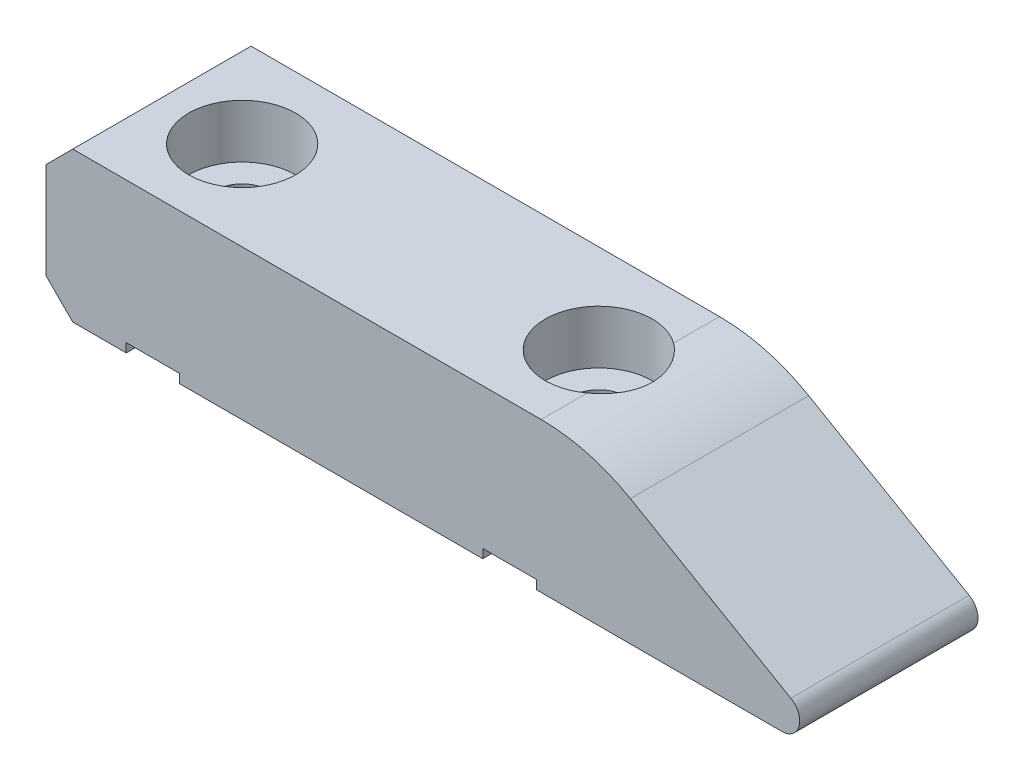
ISO-10303-21;
HEADER;
FILE_DESCRIPTION(('STEP AP214'),'2;1');
FILE_NAME('part.step','',(''),(''),'','','');
FILE_SCHEMA(('AUTOMOTIVE_DESIGN { 1 0 10303 214 1 1 1 1 }'));
ENDSEC;
DATA;
#1=APPLICATION_CONTEXT('core data for automotive mechanical design processes');
#2=APPLICATION_PROTOCOL_DEFINITION('international standard','automotive_design',2000,#1);
#3=PRODUCT_CONTEXT('',#1,'mechanical');
#4=PRODUCT('Part','Part','',(#3));
#5=PRODUCT_RELATED_PRODUCT_CATEGORY('part','',(#4));
#6=PRODUCT_DEFINITION_FORMATION('','',#4);
#7=PRODUCT_DEFINITION_CONTEXT('part definition',#1,'design');
#8=PRODUCT_DEFINITION('design','',#6,#7);
#9=PRODUCT_DEFINITION_SHAPE('','',#8);
#10=(LENGTH_UNIT() NAMED_UNIT(*) SI_UNIT(.MILLI.,.METRE.));
#11=(NAMED_UNIT(*) PLANE_ANGLE_UNIT() SI_UNIT($,.RADIAN.));
#12=(NAMED_UNIT(*) SI_UNIT($,.STERADIAN.) SOLID_ANGLE_UNIT());
#13=UNCERTAINTY_MEASURE_WITH_UNIT(LENGTH_MEASURE(1.E-05),#10,'distance_accuracy_value','');
#14=(GEOMETRIC_REPRESENTATION_CONTEXT(3) GLOBAL_UNCERTAINTY_ASSIGNED_CONTEXT((#13)) GLOBAL_UNIT_ASSIGNED_CONTEXT((#10,
#11,#12)) REPRESENTATION_CONTEXT('',''));
#15=CARTESIAN_POINT('',(0.,0.,0.));
#16=DIRECTION('',(0.,0.,1.));
#17=DIRECTION('',(1.,0.,0.));
#18=AXIS2_PLACEMENT_3D('',#15,#16,#17);
#19=CARTESIAN_POINT('',(-45.,0.,5.));
#20=DIRECTION('',(0.,1.,0.));
#21=DIRECTION('',(0.,0.,1.));
#22=AXIS2_PLACEMENT_3D('',#19,#20,#21);
#23=PLANE('',#22);
#24=DIRECTION('',(1.,0.,0.));
#25=VECTOR('',#24,1.);
#26=CARTESIAN_POINT('',(-45.,0.,5.));
#27=LINE('',#26,#25);
#28=CARTESIAN_POINT('',(-17.4946618485802,0.,5.));
#29=VERTEX_POINT('',#28);
#30=CARTESIAN_POINT('',(-3.73205080756894,0.,5.));
#31=VERTEX_POINT('',#30);
#32=EDGE_CURVE('E278',#29,#31,#27,.T.);
#33=ORIENTED_EDGE('',*,*,#32,.F.);
#34=DIRECTION('',(0.,0.,1.));
#35=VECTOR('',#34,1.);
#36=CARTESIAN_POINT('',(-17.4946618485802,0.,-4.99999999999994));
#37=LINE('',#36,#35);
#38=CARTESIAN_POINT('',(-17.4946618485802,0.,-4.99999999999994));
#39=VERTEX_POINT('',#38);
#40=EDGE_CURVE('E168',#39,#29,#37,.T.);
#41=ORIENTED_EDGE('',*,*,#40,.F.);
#42=DIRECTION('',(1.,0.,0.));
#43=VECTOR('',#42,1.);
#44=CARTESIAN_POINT('',(-45.,0.,-5.));
#45=LINE('',#44,#43);
#46=CARTESIAN_POINT('',(-3.73205080756894,0.,-5.));
#47=VERTEX_POINT('',#46);
#48=EDGE_CURVE('E295',#39,#47,#45,.T.);
#49=ORIENTED_EDGE('',*,*,#48,.T.);
#50=DIRECTION('',(0.,0.,-1.));
#51=VECTOR('',#50,1.);
#52=CARTESIAN_POINT('',(-3.73205080756892,0.,5.));
#53=LINE('',#52,#51);
#54=EDGE_CURVE('E398',#47,#31,#53,.F.);
#55=ORIENTED_EDGE('',*,*,#54,.T.);
#56=EDGE_LOOP('',(#33,#41,#49,#55));
#57=FACE_BOUND('',#56,.T.);
#58=ADVANCED_FACE('F38',(#57),#23,.F.);
#59=CARTESIAN_POINT('',(-37.5,0.,-4.99999999999997));
#60=VERTEX_POINT('',#59);
#61=CARTESIAN_POINT('',(-20.5053381514198,0.,-4.99999999999994));
#62=VERTEX_POINT('',#61);
#63=EDGE_CURVE('E294',#60,#62,#45,.T.);
#64=ORIENTED_EDGE('',*,*,#63,.T.);
#65=DIRECTION('',(0.,0.,-1.));
#66=VECTOR('',#65,1.);
#67=CARTESIAN_POINT('',(-20.5053381514198,0.,-4.99999999999994));
#68=LINE('',#67,#66);
#69=CARTESIAN_POINT('',(-20.5053381514198,0.,5.));
#70=VERTEX_POINT('',#69);
#71=EDGE_CURVE('E183',#70,#62,#68,.T.);
#72=ORIENTED_EDGE('',*,*,#71,.F.);
#73=CARTESIAN_POINT('',(-37.5,0.,5.));
#74=VERTEX_POINT('',#73);
#75=EDGE_CURVE('E277',#74,#70,#27,.T.);
#76=ORIENTED_EDGE('',*,*,#75,.F.);
#77=DIRECTION('',(0.,0.,1.));
#78=VECTOR('',#77,1.);
#79=CARTESIAN_POINT('',(-37.5,0.,-4.99999999999997));
#80=LINE('',#79,#78);
#81=EDGE_CURVE('E213',#60,#74,#80,.T.);
#82=ORIENTED_EDGE('',*,*,#81,.F.);
#83=EDGE_LOOP('',(#64,#72,#76,#82));
#84=FACE_BOUND('',#83,.T.);
#85=ADVANCED_FACE('F354',(#84),#23,.F.);
#86=CARTESIAN_POINT('',(-19.,0.,0.));
#87=DIRECTION('',(0.,1.,0.));
#88=DIRECTION('',(-1.,0.,0.));
#89=AXIS2_PLACEMENT_3D('',#86,#87,#88);
#90=CYLINDRICAL_SURFACE('',#89,1.5);
#91=CARTESIAN_POINT('',(-19.,0.5,0.));
#92=DIRECTION('',(0.,1.,0.));
#93=DIRECTION('',(0.,0.,1.));
#94=AXIS2_PLACEMENT_3D('',#91,#92,#93);
#95=CIRCLE('',#94,1.5);
#96=CARTESIAN_POINT('',(-19.,0.5,1.5));
#97=VERTEX_POINT('',#96);
#98=EDGE_CURVE('E203',#97,#97,#95,.F.);
#99=ORIENTED_EDGE('',*,*,#98,.T.);
#100=EDGE_LOOP('',(#99));
#101=FACE_BOUND('',#100,.T.);
#102=CARTESIAN_POINT('',(-19.,5.4,0.));
#103=DIRECTION('',(0.,1.,0.));
#104=DIRECTION('',(-1.,0.,0.));
#105=AXIS2_PLACEMENT_3D('',#102,#103,#104);
#106=CIRCLE('',#105,1.5);
#107=CARTESIAN_POINT('',(-20.5,5.4,0.));
#108=VERTEX_POINT('',#107);
#109=EDGE_CURVE('E258',#108,#108,#106,.F.);
#110=ORIENTED_EDGE('',*,*,#109,.F.);
#111=EDGE_LOOP('',(#110));
#112=FACE_BOUND('',#111,.T.);
#113=ADVANCED_FACE('F350',(#101,#112),#90,.F.);
#114=CARTESIAN_POINT('',(-39.,0.,0.));
#115=DIRECTION('',(0.,1.,0.));
#116=DIRECTION('',(-1.,0.,0.));
#117=AXIS2_PLACEMENT_3D('',#114,#115,#116);
#118=CYLINDRICAL_SURFACE('',#117,1.5);
#119=CARTESIAN_POINT('',(-39.,0.5,0.));
#120=DIRECTION('',(0.,1.,0.));
#121=DIRECTION('',(0.,0.,1.));
#122=AXIS2_PLACEMENT_3D('',#119,#120,#121);
#123=CIRCLE('',#122,1.5);
#124=CARTESIAN_POINT('',(-37.5,0.5,0.));
#125=VERTEX_POINT('',#124);
#126=CARTESIAN_POINT('',(-40.5,0.5,0.));
#127=VERTEX_POINT('',#126);
#128=EDGE_CURVE('E238',#125,#127,#123,.F.);
#129=ORIENTED_EDGE('',*,*,#128,.T.);
#130=EDGE_CURVE('E253',#127,#125,#123,.F.);
#131=ORIENTED_EDGE('',*,*,#130,.T.);
#132=EDGE_LOOP('',(#129,#131));
#133=FACE_BOUND('',#132,.T.);
#134=CARTESIAN_POINT('',(-39.,5.4,0.));
#135=DIRECTION('',(0.,1.,0.));
#136=DIRECTION('',(-1.,0.,0.));
#137=AXIS2_PLACEMENT_3D('',#134,#135,#136);
#138=CIRCLE('',#137,1.5);
#139=CARTESIAN_POINT('',(-40.5,5.4,0.));
#140=VERTEX_POINT('',#139);
#141=EDGE_CURVE('E267',#140,#140,#138,.F.);
#142=ORIENTED_EDGE('',*,*,#141,.F.);
#143=EDGE_LOOP('',(#142));
#144=FACE_BOUND('',#143,.T.);
#145=ADVANCED_FACE('F353',(#133,#144),#118,.F.);
#146=CARTESIAN_POINT('',(-43.5,0.,-5.));
#147=VERTEX_POINT('',#146);
#148=CARTESIAN_POINT('',(-40.5,0.,-4.99999999999997));
#149=VERTEX_POINT('',#148);
#150=EDGE_CURVE('E289',#147,#149,#45,.T.);
#151=ORIENTED_EDGE('',*,*,#150,.T.);
#152=DIRECTION('',(0.,0.,-1.));
#153=VECTOR('',#152,1.);
#154=CARTESIAN_POINT('',(-40.5,0.,-4.99999999999997));
#155=LINE('',#154,#153);
#156=CARTESIAN_POINT('',(-40.5,0.,5.));
#157=VERTEX_POINT('',#156);
#158=EDGE_CURVE('E232',#157,#149,#155,.T.);
#159=ORIENTED_EDGE('',*,*,#158,.F.);
#160=CARTESIAN_POINT('',(-43.5,0.,5.));
#161=VERTEX_POINT('',#160);
#162=EDGE_CURVE('E272',#161,#157,#27,.T.);
#163=ORIENTED_EDGE('',*,*,#162,.F.);
#164=DIRECTION('',(0.,0.,-1.));
#165=VECTOR('',#164,1.);
#166=CARTESIAN_POINT('',(-43.5,0.,5.));
#167=LINE('',#166,#165);
#168=EDGE_CURVE('E415',#161,#147,#167,.T.);
#169=ORIENTED_EDGE('',*,*,#168,.T.);
#170=EDGE_LOOP('',(#151,#159,#163,#169));
#171=FACE_BOUND('',#170,.T.);
#172=ADVANCED_FACE('F358',(#171),#23,.F.);
#173=CARTESIAN_POINT('',(0.,0.,5.));
#174=DIRECTION('',(-0.499999999999995,-0.866025403784442,0.));
#175=DIRECTION('',(0.866025403784442,-0.499999999999995,0.));
#176=AXIS2_PLACEMENT_3D('',#173,#174,#175);
#177=PLANE('',#176);
#178=DIRECTION('',(-0.866025403784442,0.499999999999995,0.));
#179=VECTOR('',#178,1.);
#180=CARTESIAN_POINT('',(0.,0.,5.));
#181=LINE('',#180,#179);
#182=CARTESIAN_POINT('',(-3.23205080756893,1.86602540378444,5.));
#183=VERTEX_POINT('',#182);
#184=CARTESIAN_POINT('',(-12.22871870789,7.06025403784442,5.));
#185=VERTEX_POINT('',#184);
#186=EDGE_CURVE('E276',#183,#185,#181,.T.);
#187=ORIENTED_EDGE('',*,*,#186,.F.);
#188=DIRECTION('',(0.,0.,-1.));
#189=VECTOR('',#188,1.);
#190=CARTESIAN_POINT('',(-3.23205080756893,1.86602540378444,5.));
#191=LINE('',#190,#189);
#192=CARTESIAN_POINT('',(-3.23205080756893,1.86602540378444,-5.));
#193=VERTEX_POINT('',#192);
#194=EDGE_CURVE('E407',#183,#193,#191,.T.);
#195=ORIENTED_EDGE('',*,*,#194,.T.);
#196=DIRECTION('',(-0.866025403784442,0.499999999999995,0.));
#197=VECTOR('',#196,1.);
#198=CARTESIAN_POINT('',(0.,0.,-5.));
#199=LINE('',#198,#197);
#200=CARTESIAN_POINT('',(-12.22871870789,7.06025403784442,-5.));
#201=VERTEX_POINT('',#200);
#202=EDGE_CURVE('E293',#193,#201,#199,.T.);
#203=ORIENTED_EDGE('',*,*,#202,.T.);
#204=DIRECTION('',(0.,0.,-1.));
#205=VECTOR('',#204,1.);
#206=CARTESIAN_POINT('',(-12.22871870789,7.06025403784442,5.));
#207=LINE('',#206,#205);
#208=EDGE_CURVE('E462',#201,#185,#207,.F.);
#209=ORIENTED_EDGE('',*,*,#208,.T.);
#210=EDGE_LOOP('',(#187,#195,#203,#209));
#211=FACE_BOUND('',#210,.T.);
#212=ADVANCED_FACE('F372',(#211),#177,.F.);
#213=CARTESIAN_POINT('',(-14.5492267835788,8.4,5.));
#214=DIRECTION('',(0.,-1.,0.));
#215=DIRECTION('',(1.,0.,0.));
#216=AXIS2_PLACEMENT_3D('',#213,#214,#215);
#217=PLANE('',#216);
#218=DIRECTION('',(-1.,0.,0.));
#219=VECTOR('',#218,1.);
#220=CARTESIAN_POINT('',(-14.5492267835788,8.4,-5.));
#221=LINE('',#220,#219);
#222=CARTESIAN_POINT('',(-17.22871870789,8.4,-5.));
#223=VERTEX_POINT('',#222);
#224=CARTESIAN_POINT('',(-43.5,8.4,-5.));
#225=VERTEX_POINT('',#224);
#226=EDGE_CURVE('E298',#223,#225,#221,.T.);
#227=ORIENTED_EDGE('',*,*,#226,.T.);
#228=DIRECTION('',(0.,0.,1.));
#229=VECTOR('',#228,1.);
#230=CARTESIAN_POINT('',(-43.5,8.4,5.));
#231=LINE('',#230,#229);
#232=CARTESIAN_POINT('',(-43.5,8.4,5.));
#233=VERTEX_POINT('',#232);
#234=EDGE_CURVE('E11',#225,#233,#231,.T.);
#235=ORIENTED_EDGE('',*,*,#234,.T.);
#236=DIRECTION('',(-1.,0.,0.));
#237=VECTOR('',#236,1.);
#238=CARTESIAN_POINT('',(-14.5492267835788,8.4,5.));
#239=LINE('',#238,#237);
#240=CARTESIAN_POINT('',(-17.22871870789,8.4,5.));
#241=VERTEX_POINT('',#240);
#242=EDGE_CURVE('E281',#241,#233,#239,.T.);
#243=ORIENTED_EDGE('',*,*,#242,.F.);
#244=DIRECTION('',(0.,0.,-1.));
#245=VECTOR('',#244,1.);
#246=CARTESIAN_POINT('',(-17.22871870789,8.4,5.));
#247=LINE('',#246,#245);
#248=CARTESIAN_POINT('',(-17.22871870789,8.4,2.42127292642137));
#249=VERTEX_POINT('',#248);
#250=EDGE_CURVE('E314',#241,#249,#247,.T.);
#251=ORIENTED_EDGE('',*,*,#250,.T.);
#252=CARTESIAN_POINT('',(-19.,8.4,0.));
#253=DIRECTION('',(0.,1.,0.));
#254=DIRECTION('',(-1.,0.,0.));
#255=AXIS2_PLACEMENT_3D('',#252,#253,#254);
#256=CIRCLE('',#255,3.);
#257=CARTESIAN_POINT('',(-17.22871870789,8.4,-2.42127292642137));
#258=VERTEX_POINT('',#257);
#259=EDGE_CURVE('E259',#258,#249,#256,.T.);
#260=ORIENTED_EDGE('',*,*,#259,.F.);
#261=DIRECTION('',(0.,0.,-1.));
#262=VECTOR('',#261,1.);
#263=CARTESIAN_POINT('',(-17.22871870789,8.4,5.));
#264=LINE('',#263,#262);
#265=EDGE_CURVE('E288',#258,#223,#264,.T.);
#266=ORIENTED_EDGE('',*,*,#265,.T.);
#267=EDGE_LOOP('',(#227,#235,#243,#251,#260,#266));
#268=FACE_BOUND('',#267,.T.);
#269=CARTESIAN_POINT('',(-39.,8.4,0.));
#270=DIRECTION('',(0.,1.,0.));
#271=DIRECTION('',(-1.,0.,0.));
#272=AXIS2_PLACEMENT_3D('',#269,#270,#271);
#273=CIRCLE('',#272,3.);
#274=CARTESIAN_POINT('',(-42.,8.4,0.));
#275=VERTEX_POINT('',#274);
#276=EDGE_CURVE('E268',#275,#275,#273,.T.);
#277=ORIENTED_EDGE('',*,*,#276,.F.);
#278=EDGE_LOOP('',(#277));
#279=FACE_BOUND('',#278,.T.);
#280=ADVANCED_FACE('F368',(#268,#279),#217,.F.);
#281=CARTESIAN_POINT('',(-45.,8.4,5.));
#282=DIRECTION('',(1.,0.,0.));
#283=DIRECTION('',(0.,0.,-1.));
#284=AXIS2_PLACEMENT_3D('',#281,#282,#283);
#285=PLANE('',#284);
#286=DIRECTION('',(0.,-1.,0.));
#287=VECTOR('',#286,1.);
#288=CARTESIAN_POINT('',(-45.,8.4,-5.));
#289=LINE('',#288,#287);
#290=CARTESIAN_POINT('',(-45.,6.90000000000002,-5.));
#291=VERTEX_POINT('',#290);
#292=CARTESIAN_POINT('',(-45.,1.50000000000002,-5.));
#293=VERTEX_POINT('',#292);
#294=EDGE_CURVE('E302',#291,#293,#289,.T.);
#295=ORIENTED_EDGE('',*,*,#294,.T.);
#296=DIRECTION('',(0.,0.,1.));
#297=VECTOR('',#296,1.);
#298=CARTESIAN_POINT('',(-45.,1.50000000000002,5.));
#299=LINE('',#298,#297);
#300=CARTESIAN_POINT('',(-45.,1.50000000000002,5.));
#301=VERTEX_POINT('',#300);
#302=EDGE_CURVE('E431',#293,#301,#299,.T.);
#303=ORIENTED_EDGE('',*,*,#302,.T.);
#304=DIRECTION('',(0.,-1.,0.));
#305=VECTOR('',#304,1.);
#306=CARTESIAN_POINT('',(-45.,8.4,5.));
#307=LINE('',#306,#305);
#308=CARTESIAN_POINT('',(-45.,6.90000000000001,5.));
#309=VERTEX_POINT('',#308);
#310=EDGE_CURVE('E285',#309,#301,#307,.T.);
#311=ORIENTED_EDGE('',*,*,#310,.F.);
#312=DIRECTION('',(0.,0.,-1.));
#313=VECTOR('',#312,1.);
#314=CARTESIAN_POINT('',(-45.,6.90000000000001,5.));
#315=LINE('',#314,#313);
#316=EDGE_CURVE('E427',#309,#291,#315,.T.);
#317=ORIENTED_EDGE('',*,*,#316,.T.);
#318=EDGE_LOOP('',(#295,#303,#311,#317));
#319=FACE_BOUND('',#318,.T.);
#320=ADVANCED_FACE('F362',(#319),#285,.F.);
#321=CARTESIAN_POINT('',(0.,0.,5.));
#322=DIRECTION('',(0.,0.,-1.));
#323=DIRECTION('',(-1.,0.,0.));
#324=AXIS2_PLACEMENT_3D('',#321,#322,#323);
#325=PLANE('',#324);
#326=DIRECTION('',(-1.,0.,0.));
#327=VECTOR('',#326,1.);
#328=CARTESIAN_POINT('',(-20.5053381514198,0.5,5.));
#329=LINE('',#328,#327);
#330=CARTESIAN_POINT('',(-17.4946618485802,0.5,5.));
#331=VERTEX_POINT('',#330);
#332=CARTESIAN_POINT('',(-20.5053381514198,0.5,5.));
#333=VERTEX_POINT('',#332);
#334=EDGE_CURVE('E178',#331,#333,#329,.T.);
#335=ORIENTED_EDGE('',*,*,#334,.F.);
#336=DIRECTION('',(0.,-1.,0.));
#337=VECTOR('',#336,1.);
#338=CARTESIAN_POINT('',(-17.4946618485802,0.5,5.));
#339=LINE('',#338,#337);
#340=EDGE_CURVE('E163',#331,#29,#339,.T.);
#341=ORIENTED_EDGE('',*,*,#340,.T.);
#342=ORIENTED_EDGE('',*,*,#32,.T.);
#343=CARTESIAN_POINT('',(-3.73205080756892,1.,5.));
#344=DIRECTION('',(0.,0.,-1.));
#345=DIRECTION('',(-1.,0.,0.));
#346=AXIS2_PLACEMENT_3D('',#343,#344,#345);
#347=CIRCLE('',#346,1.);
#348=EDGE_CURVE('E410',#31,#183,#347,.F.);
#349=ORIENTED_EDGE('',*,*,#348,.T.);
#350=ORIENTED_EDGE('',*,*,#186,.T.);
#351=CARTESIAN_POINT('',(-17.22871870789,-1.6,5.));
#352=DIRECTION('',(0.,0.,-1.));
#353=DIRECTION('',(-1.,0.,0.));
#354=AXIS2_PLACEMENT_3D('',#351,#352,#353);
#355=CIRCLE('',#354,10.);
#356=EDGE_CURVE('E465',#185,#241,#355,.F.);
#357=ORIENTED_EDGE('',*,*,#356,.T.);
#358=ORIENTED_EDGE('',*,*,#242,.T.);
#359=DIRECTION('',(0.707106781186551,0.707106781186544,0.));
#360=VECTOR('',#359,1.);
#361=CARTESIAN_POINT('',(-45.,6.90000000000001,5.));
#362=LINE('',#361,#360);
#363=EDGE_CURVE('E434',#233,#309,#362,.F.);
#364=ORIENTED_EDGE('',*,*,#363,.T.);
#365=ORIENTED_EDGE('',*,*,#310,.T.);
#366=DIRECTION('',(-0.707106781186544,0.707106781186551,0.));
#367=VECTOR('',#366,1.);
#368=CARTESIAN_POINT('',(-43.5,0.,5.));
#369=LINE('',#368,#367);
#370=EDGE_CURVE('E47',#301,#161,#369,.F.);
#371=ORIENTED_EDGE('',*,*,#370,.T.);
#372=ORIENTED_EDGE('',*,*,#162,.T.);
#373=DIRECTION('',(0.,-1.,0.));
#374=VECTOR('',#373,1.);
#375=CARTESIAN_POINT('',(-40.5,0.5,5.));
#376=LINE('',#375,#374);
#377=CARTESIAN_POINT('',(-40.5,0.5,5.));
#378=VERTEX_POINT('',#377);
#379=EDGE_CURVE('E243',#378,#157,#376,.T.);
#380=ORIENTED_EDGE('',*,*,#379,.F.);
#381=DIRECTION('',(-1.,0.,0.));
#382=VECTOR('',#381,1.);
#383=CARTESIAN_POINT('',(-40.5,0.5,5.));
#384=LINE('',#383,#382);
#385=CARTESIAN_POINT('',(-37.5,0.5,5.));
#386=VERTEX_POINT('',#385);
#387=EDGE_CURVE('E218',#386,#378,#384,.T.);
#388=ORIENTED_EDGE('',*,*,#387,.F.);
#389=DIRECTION('',(0.,-1.,0.));
#390=VECTOR('',#389,1.);
#391=CARTESIAN_POINT('',(-37.5,0.5,5.));
#392=LINE('',#391,#390);
#393=EDGE_CURVE('E229',#386,#74,#392,.T.);
#394=ORIENTED_EDGE('',*,*,#393,.T.);
#395=ORIENTED_EDGE('',*,*,#75,.T.);
#396=DIRECTION('',(0.,-1.,0.));
#397=VECTOR('',#396,1.);
#398=CARTESIAN_POINT('',(-20.5053381514198,0.5,5.));
#399=LINE('',#398,#397);
#400=EDGE_CURVE('E173',#333,#70,#399,.T.);
#401=ORIENTED_EDGE('',*,*,#400,.F.);
#402=EDGE_LOOP('',(#335,#341,#342,#349,#350,#357,#358,#364,#365,#371,#372,#380,#388,#394,#395,#401));
#403=FACE_BOUND('',#402,.T.);
#404=ADVANCED_FACE('F185',(#403),#325,.F.);
#405=CARTESIAN_POINT('',(0.,0.,-5.));
#406=DIRECTION('',(0.,0.,-1.));
#407=DIRECTION('',(-1.,0.,0.));
#408=AXIS2_PLACEMENT_3D('',#405,#406,#407);
#409=PLANE('',#408);
#410=DIRECTION('',(0.,-1.,0.));
#411=VECTOR('',#410,1.);
#412=CARTESIAN_POINT('',(-17.4946618485802,0.5,-4.99999999999994));
#413=LINE('',#412,#411);
#414=CARTESIAN_POINT('',(-17.4946618485802,0.5,-4.99999999999994));
#415=VERTEX_POINT('',#414);
#416=EDGE_CURVE('E200',#415,#39,#413,.T.);
#417=ORIENTED_EDGE('',*,*,#416,.F.);
#418=DIRECTION('',(1.,0.,0.));
#419=VECTOR('',#418,1.);
#420=CARTESIAN_POINT('',(-20.5053381514198,0.5,-4.99999999999994));
#421=LINE('',#420,#419);
#422=CARTESIAN_POINT('',(-20.5053381514198,0.5,-5.));
#423=VERTEX_POINT('',#422);
#424=EDGE_CURVE('E174',#423,#415,#421,.T.);
#425=ORIENTED_EDGE('',*,*,#424,.F.);
#426=DIRECTION('',(0.,-1.,0.));
#427=VECTOR('',#426,1.);
#428=CARTESIAN_POINT('',(-20.5053381514198,0.5,-4.99999999999994));
#429=LINE('',#428,#427);
#430=EDGE_CURVE('E204',#423,#62,#429,.T.);
#431=ORIENTED_EDGE('',*,*,#430,.T.);
#432=ORIENTED_EDGE('',*,*,#63,.F.);
#433=DIRECTION('',(0.,-1.,0.));
#434=VECTOR('',#433,1.);
#435=CARTESIAN_POINT('',(-37.5,0.5,-4.99999999999997));
#436=LINE('',#435,#434);
#437=CARTESIAN_POINT('',(-37.5,0.5,-4.99999999999997));
#438=VERTEX_POINT('',#437);
#439=EDGE_CURVE('E235',#438,#60,#436,.T.);
#440=ORIENTED_EDGE('',*,*,#439,.F.);
#441=DIRECTION('',(1.,0.,0.));
#442=VECTOR('',#441,1.);
#443=CARTESIAN_POINT('',(-40.5,0.5,-4.99999999999997));
#444=LINE('',#443,#442);
#445=CARTESIAN_POINT('',(-40.5,0.5,-5.));
#446=VERTEX_POINT('',#445);
#447=EDGE_CURVE('E225',#446,#438,#444,.T.);
#448=ORIENTED_EDGE('',*,*,#447,.F.);
#449=DIRECTION('',(0.,-1.,0.));
#450=VECTOR('',#449,1.);
#451=CARTESIAN_POINT('',(-40.5,0.5,-4.99999999999997));
#452=LINE('',#451,#450);
#453=EDGE_CURVE('E239',#446,#149,#452,.T.);
#454=ORIENTED_EDGE('',*,*,#453,.T.);
#455=ORIENTED_EDGE('',*,*,#150,.F.);
#456=DIRECTION('',(0.707106781186544,-0.707106781186551,0.));
#457=VECTOR('',#456,1.);
#458=CARTESIAN_POINT('',(-21.7500000000002,-21.75,-5.));
#459=LINE('',#458,#457);
#460=EDGE_CURVE('E425',#147,#293,#459,.F.);
#461=ORIENTED_EDGE('',*,*,#460,.T.);
#462=ORIENTED_EDGE('',*,*,#294,.F.);
#463=DIRECTION('',(-0.707106781186551,-0.707106781186544,0.));
#464=VECTOR('',#463,1.);
#465=CARTESIAN_POINT('',(-25.9499999999998,25.95,-5.));
#466=LINE('',#465,#464);
#467=EDGE_CURVE('E422',#291,#225,#466,.F.);
#468=ORIENTED_EDGE('',*,*,#467,.T.);
#469=ORIENTED_EDGE('',*,*,#226,.F.);
#470=CARTESIAN_POINT('',(-17.22871870789,-1.6,-5.));
#471=DIRECTION('',(0.,0.,-1.));
#472=DIRECTION('',(-1.,0.,0.));
#473=AXIS2_PLACEMENT_3D('',#470,#471,#472);
#474=CIRCLE('',#473,10.);
#475=EDGE_CURVE('E327',#223,#201,#474,.T.);
#476=ORIENTED_EDGE('',*,*,#475,.T.);
#477=ORIENTED_EDGE('',*,*,#202,.F.);
#478=CARTESIAN_POINT('',(-3.73205080756892,1.,-5.));
#479=DIRECTION('',(0.,0.,-1.));
#480=DIRECTION('',(-1.,0.,0.));
#481=AXIS2_PLACEMENT_3D('',#478,#479,#480);
#482=CIRCLE('',#481,1.);
#483=EDGE_CURVE('E401',#193,#47,#482,.T.);
#484=ORIENTED_EDGE('',*,*,#483,.T.);
#485=ORIENTED_EDGE('',*,*,#48,.F.);
#486=EDGE_LOOP('',(#417,#425,#431,#432,#440,#448,#454,#455,#461,#462,#468,#469,#476,#477,#484,#485));
#487=FACE_BOUND('',#486,.T.);
#488=ADVANCED_FACE('F345',(#487),#409,.T.);
#489=CARTESIAN_POINT('',(-39.,5.4,0.));
#490=DIRECTION('',(0.,1.,0.));
#491=DIRECTION('',(-1.,0.,0.));
#492=AXIS2_PLACEMENT_3D('',#489,#490,#491);
#493=PLANE('',#492);
#494=CARTESIAN_POINT('',(-39.,5.4,0.));
#495=DIRECTION('',(0.,1.,0.));
#496=DIRECTION('',(-1.,0.,0.));
#497=AXIS2_PLACEMENT_3D('',#494,#495,#496);
#498=CIRCLE('',#497,3.);
#499=CARTESIAN_POINT('',(-42.,5.4,0.));
#500=VERTEX_POINT('',#499);
#501=EDGE_CURVE('E263',#500,#500,#498,.T.);
#502=ORIENTED_EDGE('',*,*,#501,.T.);
#503=EDGE_LOOP('',(#502));
#504=FACE_BOUND('',#503,.T.);
#505=ORIENTED_EDGE('',*,*,#141,.T.);
#506=EDGE_LOOP('',(#505));
#507=FACE_BOUND('',#506,.T.);
#508=ADVANCED_FACE('F341',(#504,#507),#493,.T.);
#509=CARTESIAN_POINT('',(-39.,5.4,0.));
#510=DIRECTION('',(0.,1.,0.));
#511=DIRECTION('',(-1.,0.,0.));
#512=AXIS2_PLACEMENT_3D('',#509,#510,#511);
#513=CYLINDRICAL_SURFACE('',#512,3.);
#514=ORIENTED_EDGE('',*,*,#501,.F.);
#515=EDGE_LOOP('',(#514));
#516=FACE_BOUND('',#515,.T.);
#517=ORIENTED_EDGE('',*,*,#276,.T.);
#518=EDGE_LOOP('',(#517));
#519=FACE_BOUND('',#518,.T.);
#520=ADVANCED_FACE('F344',(#516,#519),#513,.F.);
#521=CARTESIAN_POINT('',(-19.,5.4,0.));
#522=DIRECTION('',(0.,1.,0.));
#523=DIRECTION('',(-1.,0.,0.));
#524=AXIS2_PLACEMENT_3D('',#521,#522,#523);
#525=PLANE('',#524);
#526=CARTESIAN_POINT('',(-19.,5.4,0.));
#527=DIRECTION('',(0.,1.,0.));
#528=DIRECTION('',(-1.,0.,0.));
#529=AXIS2_PLACEMENT_3D('',#526,#527,#528);
#530=CIRCLE('',#529,3.);
#531=CARTESIAN_POINT('',(-22.,5.4,0.));
#532=VERTEX_POINT('',#531);
#533=EDGE_CURVE('E254',#532,#532,#530,.T.);
#534=ORIENTED_EDGE('',*,*,#533,.T.);
#535=EDGE_LOOP('',(#534));
#536=FACE_BOUND('',#535,.T.);
#537=ORIENTED_EDGE('',*,*,#109,.T.);
#538=EDGE_LOOP('',(#537));
#539=FACE_BOUND('',#538,.T.);
#540=ADVANCED_FACE('F338',(#536,#539),#525,.T.);
#541=CARTESIAN_POINT('',(-19.,5.4,0.));
#542=DIRECTION('',(0.,1.,0.));
#543=DIRECTION('',(-1.,0.,0.));
#544=AXIS2_PLACEMENT_3D('',#541,#542,#543);
#545=CYLINDRICAL_SURFACE('',#544,3.);
#546=ORIENTED_EDGE('',*,*,#533,.F.);
#547=EDGE_LOOP('',(#546));
#548=FACE_BOUND('',#547,.T.);
#549=ORIENTED_EDGE('',*,*,#259,.T.);
#550=CARTESIAN_POINT('',(-17.22871870789,8.4,2.42127292642137));
#551=CARTESIAN_POINT('',(-17.1607888428043,8.40000247234104,2.37158940658001));
#552=CARTESIAN_POINT('',(-17.0949666314335,8.39930779253446,2.31903882174168));
#553=CARTESIAN_POINT('',(-16.9679868226225,8.39680138935731,2.20861669729403));
#554=CARTESIAN_POINT('',(-16.9068285350805,8.39498983160842,2.15074594769366));
#555=CARTESIAN_POINT('',(-16.7896533748739,8.39052859328695,2.0301310001225));
#556=CARTESIAN_POINT('',(-16.7336323415208,8.38787959883258,1.96739082334798));
#557=CARTESIAN_POINT('',(-16.6270727606504,8.38202721701472,1.83746697311289));
#558=CARTESIAN_POINT('',(-16.5765343004243,8.37882382082639,1.77028322893119));
#559=CARTESIAN_POINT('',(-16.433674931469,8.36880331266977,1.56272940745097));
#560=CARTESIAN_POINT('',(-16.350017639058,8.36157153081106,1.41626144250431));
#561=CARTESIAN_POINT('',(-16.2084186331142,8.3480692154522,1.11146168000442));
#562=CARTESIAN_POINT('',(-16.1504728384539,8.34179852950298,0.9531317699374));
#563=CARTESIAN_POINT('',(-16.0616683723426,8.33176796276605,0.628225544285485));
#564=CARTESIAN_POINT('',(-16.0309241796716,8.32801870921999,0.461617464341738));
#565=CARTESIAN_POINT('',(-15.9978755072482,8.32397662680726,0.125551013909707));
#566=CARTESIAN_POINT('',(-15.9955731231786,8.32368405263978,-0.0439075656912524));
#567=CARTESIAN_POINT('',(-16.0193870476229,8.32661330120433,-0.379530435372666));
#568=CARTESIAN_POINT('',(-16.0452954223368,8.329809410229,-0.545709760581478));
#569=CARTESIAN_POINT('',(-16.1244477879919,8.33892117896693,-0.871366725134045));
#570=CARTESIAN_POINT('',(-16.1776951639168,8.3448371754341,-1.03084353195829));
#571=CARTESIAN_POINT('',(-16.3101844197427,8.35794760146483,-1.33907816412932));
#572=CARTESIAN_POINT('',(-16.3895016505811,8.36514570881587,-1.48780337519446));
#573=CARTESIAN_POINT('',(-16.5718869890701,8.37882175340755,-1.76986383119514));
#574=CARTESIAN_POINT('',(-16.6749366080155,8.38530024547042,-1.9032109357015));
#575=CARTESIAN_POINT('',(-16.855060028769,8.39323938198338,-2.09976416396944));
#576=CARTESIAN_POINT('',(-16.9253653622041,8.39566781086153,-2.16924802161116));
#577=CARTESIAN_POINT('',(-17.072384579378,8.39904867599249,-2.30087440183306));
#578=CARTESIAN_POINT('',(-17.1490888191872,8.40000329256688,-2.36302764308403));
#579=CARTESIAN_POINT('',(-17.22871870789,8.4,-2.42127292642137));
#580=B_SPLINE_CURVE_WITH_KNOTS('',3,(#550,#551,#552,#553,#554,#555,#556,#557,#558,#559,#560,
#561,#562,#563,#564,#565,#566,#567,#568,#569,#570,#571,#572,#573,#574,#575,#576,#577,#578,#579),
.UNSPECIFIED.,.F.,.F.,(4,2,2,2,2,2,2,2,2,2,2,2,2,2,4),(0.,0.25238920370324,0.504740989645377,
0.756886555371276,1.00903613505983,1.51294185999816,2.01676757249023,2.52270370133291,
3.02867710893543,3.53094621476508,4.03327752414454,4.53707370455984,5.04047872259079,
5.33666505376066,5.63241279288156),.UNSPECIFIED.);
#581=EDGE_CURVE('E318',#249,#258,#580,.T.);
#582=ORIENTED_EDGE('',*,*,#581,.T.);
#583=EDGE_LOOP('',(#549,#582));
#584=FACE_BOUND('',#583,.T.);
#585=ADVANCED_FACE('F333',(#548,#584),#545,.F.);
#586=CARTESIAN_POINT('',(-17.22871870789,-1.6,5.));
#587=DIRECTION('',(0.,0.,-1.));
#588=DIRECTION('',(-1.,0.,0.));
#589=AXIS2_PLACEMENT_3D('',#586,#587,#588);
#590=CYLINDRICAL_SURFACE('',#589,10.);
#591=ORIENTED_EDGE('',*,*,#356,.F.);
#592=ORIENTED_EDGE('',*,*,#208,.F.);
#593=ORIENTED_EDGE('',*,*,#475,.F.);
#594=ORIENTED_EDGE('',*,*,#265,.F.);
#595=ORIENTED_EDGE('',*,*,#581,.F.);
#596=ORIENTED_EDGE('',*,*,#250,.F.);
#597=EDGE_LOOP('',(#591,#592,#593,#594,#595,#596));
#598=FACE_BOUND('',#597,.T.);
#599=ADVANCED_FACE('F329',(#598),#590,.T.);
#600=CARTESIAN_POINT('',(-3.73205080756892,1.,5.));
#601=DIRECTION('',(0.,0.,-1.));
#602=DIRECTION('',(-1.,0.,0.));
#603=AXIS2_PLACEMENT_3D('',#600,#601,#602);
#604=CYLINDRICAL_SURFACE('',#603,1.);
#605=ORIENTED_EDGE('',*,*,#348,.F.);
#606=ORIENTED_EDGE('',*,*,#54,.F.);
#607=ORIENTED_EDGE('',*,*,#483,.F.);
#608=ORIENTED_EDGE('',*,*,#194,.F.);
#609=EDGE_LOOP('',(#605,#606,#607,#608));
#610=FACE_BOUND('',#609,.T.);
#611=ADVANCED_FACE('F409',(#610),#604,.T.);
#612=CARTESIAN_POINT('',(-43.5,0.,5.));
#613=DIRECTION('',(0.707106781186551,0.707106781186544,0.));
#614=DIRECTION('',(0.,0.,-1.));
#615=AXIS2_PLACEMENT_3D('',#612,#613,#614);
#616=PLANE('',#615);
#617=ORIENTED_EDGE('',*,*,#370,.F.);
#618=ORIENTED_EDGE('',*,*,#302,.F.);
#619=ORIENTED_EDGE('',*,*,#460,.F.);
#620=ORIENTED_EDGE('',*,*,#168,.F.);
#621=EDGE_LOOP('',(#617,#618,#619,#620));
#622=FACE_BOUND('',#621,.T.);
#623=ADVANCED_FACE('F445',(#622),#616,.F.);
#624=CARTESIAN_POINT('',(-45.,6.90000000000001,5.));
#625=DIRECTION('',(0.707106781186544,-0.707106781186551,0.));
#626=DIRECTION('',(0.,0.,-1.));
#627=AXIS2_PLACEMENT_3D('',#624,#625,#626);
#628=PLANE('',#627);
#629=ORIENTED_EDGE('',*,*,#363,.F.);
#630=ORIENTED_EDGE('',*,*,#234,.F.);
#631=ORIENTED_EDGE('',*,*,#467,.F.);
#632=ORIENTED_EDGE('',*,*,#316,.F.);
#633=EDGE_LOOP('',(#629,#630,#631,#632));
#634=FACE_BOUND('',#633,.T.);
#635=ADVANCED_FACE('F40',(#634),#628,.F.);
#636=CARTESIAN_POINT('',(-37.5,0.5,-4.99999999999997));
#637=DIRECTION('',(1.,0.,0.));
#638=DIRECTION('',(0.,0.,-1.));
#639=AXIS2_PLACEMENT_3D('',#636,#637,#638);
#640=PLANE('',#639);
#641=DIRECTION('',(0.,0.,1.));
#642=VECTOR('',#641,1.);
#643=CARTESIAN_POINT('',(-37.5,0.5,-4.99999999999997));
#644=LINE('',#643,#642);
#645=EDGE_CURVE('E214',#438,#125,#644,.T.);
#646=ORIENTED_EDGE('',*,*,#645,.F.);
#647=ORIENTED_EDGE('',*,*,#439,.T.);
#648=ORIENTED_EDGE('',*,*,#81,.T.);
#649=ORIENTED_EDGE('',*,*,#393,.F.);
#650=EDGE_CURVE('E219',#125,#386,#644,.T.);
#651=ORIENTED_EDGE('',*,*,#650,.F.);
#652=EDGE_LOOP('',(#646,#647,#648,#649,#651));
#653=FACE_BOUND('',#652,.T.);
#654=ADVANCED_FACE('F475',(#653),#640,.F.);
#655=CARTESIAN_POINT('',(-40.5,0.5,-4.99999999999997));
#656=DIRECTION('',(-1.,0.,0.));
#657=DIRECTION('',(0.,0.,1.));
#658=AXIS2_PLACEMENT_3D('',#655,#656,#657);
#659=PLANE('',#658);
#660=DIRECTION('',(0.,0.,-1.));
#661=VECTOR('',#660,1.);
#662=CARTESIAN_POINT('',(-40.5,0.5,-4.99999999999997));
#663=LINE('',#662,#661);
#664=EDGE_CURVE('E62',#378,#127,#663,.T.);
#665=ORIENTED_EDGE('',*,*,#664,.F.);
#666=ORIENTED_EDGE('',*,*,#379,.T.);
#667=ORIENTED_EDGE('',*,*,#158,.T.);
#668=ORIENTED_EDGE('',*,*,#453,.F.);
#669=EDGE_CURVE('E222',#127,#446,#663,.T.);
#670=ORIENTED_EDGE('',*,*,#669,.F.);
#671=EDGE_LOOP('',(#665,#666,#667,#668,#670));
#672=FACE_BOUND('',#671,.T.);
#673=ADVANCED_FACE('F484',(#672),#659,.F.);
#674=CARTESIAN_POINT('',(0.,0.5,0.));
#675=DIRECTION('',(0.,1.,0.));
#676=DIRECTION('',(0.,0.,1.));
#677=AXIS2_PLACEMENT_3D('',#674,#675,#676);
#678=PLANE('',#677);
#679=ORIENTED_EDGE('',*,*,#669,.T.);
#680=ORIENTED_EDGE('',*,*,#447,.T.);
#681=ORIENTED_EDGE('',*,*,#645,.T.);
#682=ORIENTED_EDGE('',*,*,#130,.F.);
#683=EDGE_LOOP('',(#679,#680,#681,#682));
#684=FACE_BOUND('',#683,.T.);
#685=ADVANCED_FACE('F479',(#684),#678,.F.);
#686=ORIENTED_EDGE('',*,*,#650,.T.);
#687=ORIENTED_EDGE('',*,*,#387,.T.);
#688=ORIENTED_EDGE('',*,*,#664,.T.);
#689=ORIENTED_EDGE('',*,*,#128,.F.);
#690=EDGE_LOOP('',(#686,#687,#688,#689));
#691=FACE_BOUND('',#690,.T.);
#692=ADVANCED_FACE('F485',(#691),#678,.F.);
#693=CARTESIAN_POINT('',(0.,0.5,0.));
#694=DIRECTION('',(0.,1.,0.));
#695=DIRECTION('',(0.,0.,1.));
#696=AXIS2_PLACEMENT_3D('',#693,#694,#695);
#697=PLANE('',#696);
#698=DIRECTION('',(0.,0.,1.));
#699=VECTOR('',#698,1.);
#700=CARTESIAN_POINT('',(-17.4946618485802,0.5,-4.99999999999994));
#701=LINE('',#700,#699);
#702=EDGE_CURVE('E166',#415,#331,#701,.T.);
#703=ORIENTED_EDGE('',*,*,#702,.T.);
#704=ORIENTED_EDGE('',*,*,#334,.T.);
#705=DIRECTION('',(0.,0.,-1.));
#706=VECTOR('',#705,1.);
#707=CARTESIAN_POINT('',(-20.5053381514198,0.5,-4.99999999999994));
#708=LINE('',#707,#706);
#709=EDGE_CURVE('E54',#333,#423,#708,.T.);
#710=ORIENTED_EDGE('',*,*,#709,.T.);
#711=ORIENTED_EDGE('',*,*,#424,.T.);
#712=EDGE_LOOP('',(#703,#704,#710,#711));
#713=FACE_BOUND('',#712,.T.);
#714=ORIENTED_EDGE('',*,*,#98,.F.);
#715=EDGE_LOOP('',(#714));
#716=FACE_BOUND('',#715,.T.);
#717=ADVANCED_FACE('F176',(#713,#716),#697,.F.);
#718=CARTESIAN_POINT('',(-17.4946618485802,0.5,-4.99999999999994));
#719=DIRECTION('',(1.,0.,0.));
#720=DIRECTION('',(0.,0.,-1.));
#721=AXIS2_PLACEMENT_3D('',#718,#719,#720);
#722=PLANE('',#721);
#723=ORIENTED_EDGE('',*,*,#40,.T.);
#724=ORIENTED_EDGE('',*,*,#340,.F.);
#725=ORIENTED_EDGE('',*,*,#702,.F.);
#726=ORIENTED_EDGE('',*,*,#416,.T.);
#727=EDGE_LOOP('',(#723,#724,#725,#726));
#728=FACE_BOUND('',#727,.T.);
#729=ADVANCED_FACE('F165',(#728),#722,.F.);
#730=CARTESIAN_POINT('',(-20.5053381514198,0.5,-4.99999999999994));
#731=DIRECTION('',(-1.,0.,0.));
#732=DIRECTION('',(0.,0.,1.));
#733=AXIS2_PLACEMENT_3D('',#730,#731,#732);
#734=PLANE('',#733);
#735=ORIENTED_EDGE('',*,*,#71,.T.);
#736=ORIENTED_EDGE('',*,*,#430,.F.);
#737=ORIENTED_EDGE('',*,*,#709,.F.);
#738=ORIENTED_EDGE('',*,*,#400,.T.);
#739=EDGE_LOOP('',(#735,#736,#737,#738));
#740=FACE_BOUND('',#739,.T.);
#741=ADVANCED_FACE('F661',(#740),#734,.F.);
#742=CLOSED_SHELL('',(#58,#85,#113,#145,#172,#212,#280,#320,#404,#488,#508,#520,#540,#585,#599,
#611,#623,#635,#654,#673,#685,#692,#717,#729,#741));
#743=MANIFOLD_SOLID_BREP('B2',#742);
#744=ADVANCED_BREP_SHAPE_REPRESENTATION('',(#18,#743),#14);
#745=SHAPE_DEFINITION_REPRESENTATION(#9,#744);
ENDSEC;
END-ISO-10303-21;
